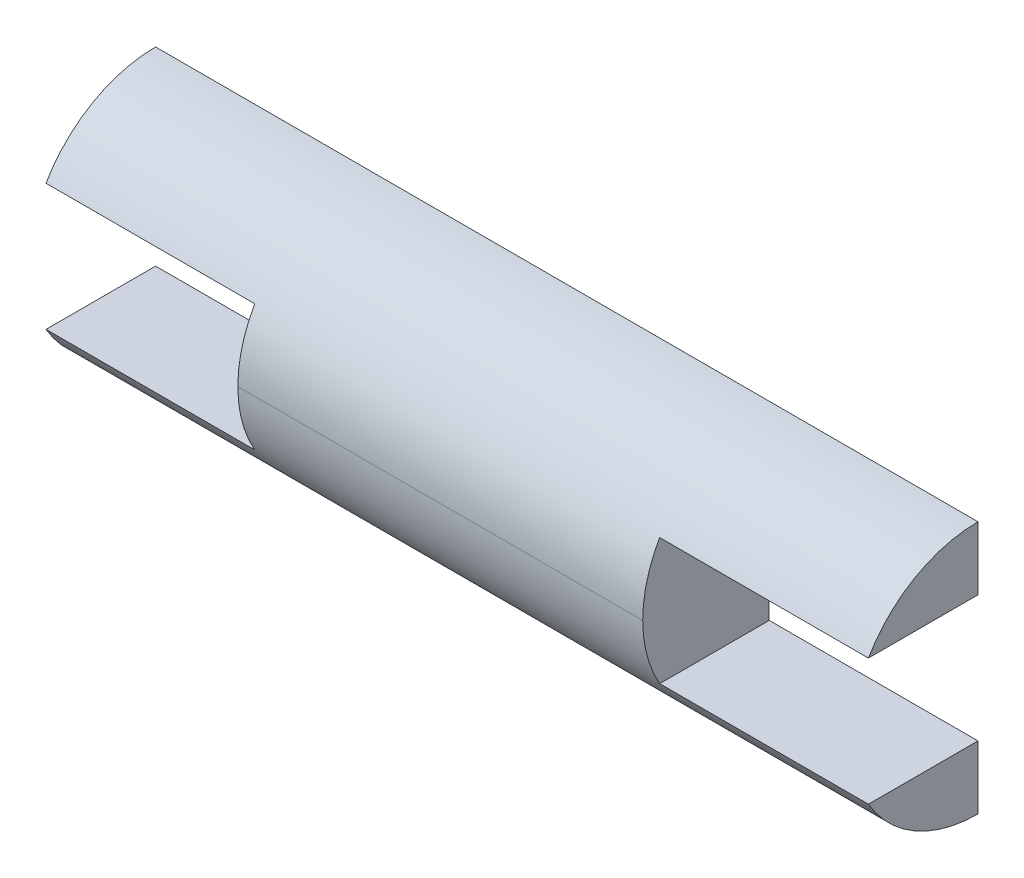
ISO-10303-21;
HEADER;
FILE_DESCRIPTION(('STEP AP214'),'2;1');
FILE_NAME('part.step','',(''),(''),'','','');
FILE_SCHEMA(('AUTOMOTIVE_DESIGN { 1 0 10303 214 1 1 1 1 }'));
ENDSEC;
DATA;
#1=APPLICATION_CONTEXT('core data for automotive mechanical design processes');
#2=APPLICATION_PROTOCOL_DEFINITION('international standard','automotive_design',2000,#1);
#3=PRODUCT_CONTEXT('',#1,'mechanical');
#4=PRODUCT('Part','Part','',(#3));
#5=PRODUCT_RELATED_PRODUCT_CATEGORY('part','',(#4));
#6=PRODUCT_DEFINITION_FORMATION('','',#4);
#7=PRODUCT_DEFINITION_CONTEXT('part definition',#1,'design');
#8=PRODUCT_DEFINITION('design','',#6,#7);
#9=PRODUCT_DEFINITION_SHAPE('','',#8);
#10=(LENGTH_UNIT() NAMED_UNIT(*) SI_UNIT(.MILLI.,.METRE.));
#11=(NAMED_UNIT(*) PLANE_ANGLE_UNIT() SI_UNIT($,.RADIAN.));
#12=(NAMED_UNIT(*) SI_UNIT($,.STERADIAN.) SOLID_ANGLE_UNIT());
#13=UNCERTAINTY_MEASURE_WITH_UNIT(LENGTH_MEASURE(1.E-05),#10,'distance_accuracy_value','');
#14=(GEOMETRIC_REPRESENTATION_CONTEXT(3) GLOBAL_UNCERTAINTY_ASSIGNED_CONTEXT((#13)) GLOBAL_UNIT_ASSIGNED_CONTEXT((#10,
#11,#12)) REPRESENTATION_CONTEXT('',''));
#15=CARTESIAN_POINT('',(0.,0.,0.));
#16=DIRECTION('',(0.,0.,1.));
#17=DIRECTION('',(1.,0.,0.));
#18=AXIS2_PLACEMENT_3D('',#15,#16,#17);
#19=CARTESIAN_POINT('',(0.,1.,2.));
#20=DIRECTION('',(1.,0.,0.));
#21=DIRECTION('',(0.,1.,0.));
#22=AXIS2_PLACEMENT_3D('',#19,#20,#21);
#23=PLANE('',#22);
#24=DIRECTION('',(0.,-1.,0.));
#25=VECTOR('',#24,1.);
#26=CARTESIAN_POINT('',(0.,1.,0.));
#27=LINE('',#26,#25);
#28=CARTESIAN_POINT('',(0.,1.,0.));
#29=VERTEX_POINT('',#28);
#30=CARTESIAN_POINT('',(0.,0.,0.));
#31=VERTEX_POINT('',#30);
#32=EDGE_CURVE('E138',#29,#31,#27,.T.);
#33=ORIENTED_EDGE('',*,*,#32,.T.);
#34=CARTESIAN_POINT('',(0.,2.,0.));
#35=DIRECTION('',(1.,0.,0.));
#36=DIRECTION('',(0.,1.,0.));
#37=AXIS2_PLACEMENT_3D('',#34,#35,#36);
#38=CIRCLE('',#37,2.);
#39=CARTESIAN_POINT('',(0.,1.,1.73205080756888));
#40=VERTEX_POINT('',#39);
#41=EDGE_CURVE('E121',#31,#40,#38,.F.);
#42=ORIENTED_EDGE('',*,*,#41,.T.);
#43=DIRECTION('',(0.,0.,-1.));
#44=VECTOR('',#43,1.);
#45=CARTESIAN_POINT('',(0.,1.,2.));
#46=LINE('',#45,#44);
#47=EDGE_CURVE('E143',#40,#29,#46,.T.);
#48=ORIENTED_EDGE('',*,*,#47,.T.);
#49=EDGE_LOOP('',(#33,#42,#48));
#50=FACE_BOUND('',#49,.T.);
#51=ADVANCED_FACE('F38',(#50),#23,.F.);
#52=CARTESIAN_POINT('',(13.,0.,2.));
#53=DIRECTION('',(-1.,0.,0.));
#54=DIRECTION('',(0.,0.,1.));
#55=AXIS2_PLACEMENT_3D('',#52,#53,#54);
#56=PLANE('',#55);
#57=DIRECTION('',(0.,0.,-1.));
#58=VECTOR('',#57,1.);
#59=CARTESIAN_POINT('',(13.,1.,2.));
#60=LINE('',#59,#58);
#61=CARTESIAN_POINT('',(13.,1.,1.73205080756888));
#62=VERTEX_POINT('',#61);
#63=CARTESIAN_POINT('',(13.,1.,0.));
#64=VERTEX_POINT('',#63);
#65=EDGE_CURVE('E187',#62,#64,#60,.T.);
#66=ORIENTED_EDGE('',*,*,#65,.F.);
#67=CARTESIAN_POINT('',(13.,2.,0.));
#68=DIRECTION('',(-1.,0.,0.));
#69=DIRECTION('',(0.,0.,1.));
#70=AXIS2_PLACEMENT_3D('',#67,#68,#69);
#71=CIRCLE('',#70,2.);
#72=CARTESIAN_POINT('',(13.,0.,0.));
#73=VERTEX_POINT('',#72);
#74=EDGE_CURVE('E131',#62,#73,#71,.F.);
#75=ORIENTED_EDGE('',*,*,#74,.T.);
#76=DIRECTION('',(0.,1.,0.));
#77=VECTOR('',#76,1.);
#78=CARTESIAN_POINT('',(13.,0.,0.));
#79=LINE('',#78,#77);
#80=EDGE_CURVE('E141',#73,#64,#79,.T.);
#81=ORIENTED_EDGE('',*,*,#80,.T.);
#82=EDGE_LOOP('',(#66,#75,#81));
#83=FACE_BOUND('',#82,.T.);
#84=ADVANCED_FACE('F235',(#83),#56,.F.);
#85=CARTESIAN_POINT('',(13.,1.,2.));
#86=DIRECTION('',(0.,-1.,0.));
#87=DIRECTION('',(1.,0.,0.));
#88=AXIS2_PLACEMENT_3D('',#85,#86,#87);
#89=PLANE('',#88);
#90=DIRECTION('',(0.,0.,-1.));
#91=VECTOR('',#90,1.);
#92=CARTESIAN_POINT('',(9.7,1.,2.));
#93=LINE('',#92,#91);
#94=CARTESIAN_POINT('',(9.7,1.,1.73205080756888));
#95=VERTEX_POINT('',#94);
#96=CARTESIAN_POINT('',(9.7,1.,0.));
#97=VERTEX_POINT('',#96);
#98=EDGE_CURVE('E185',#95,#97,#93,.T.);
#99=ORIENTED_EDGE('',*,*,#98,.F.);
#100=DIRECTION('',(-1.,0.,0.));
#101=VECTOR('',#100,1.);
#102=CARTESIAN_POINT('',(9.7,1.,1.73205080756888));
#103=LINE('',#102,#101);
#104=EDGE_CURVE('E193',#95,#62,#103,.F.);
#105=ORIENTED_EDGE('',*,*,#104,.T.);
#106=ORIENTED_EDGE('',*,*,#65,.T.);
#107=DIRECTION('',(-1.,0.,0.));
#108=VECTOR('',#107,1.);
#109=CARTESIAN_POINT('',(13.,1.,0.));
#110=LINE('',#109,#108);
#111=EDGE_CURVE('E149',#64,#97,#110,.T.);
#112=ORIENTED_EDGE('',*,*,#111,.T.);
#113=EDGE_LOOP('',(#99,#105,#106,#112));
#114=FACE_BOUND('',#113,.T.);
#115=ADVANCED_FACE('F240',(#114),#89,.F.);
#116=CARTESIAN_POINT('',(9.7,1.,2.));
#117=DIRECTION('',(-1.,0.,0.));
#118=DIRECTION('',(0.,0.,1.));
#119=AXIS2_PLACEMENT_3D('',#116,#117,#118);
#120=PLANE('',#119);
#121=CARTESIAN_POINT('',(9.7,2.,0.));
#122=DIRECTION('',(-1.,0.,0.));
#123=DIRECTION('',(0.,0.,1.));
#124=AXIS2_PLACEMENT_3D('',#121,#122,#123);
#125=CIRCLE('',#124,2.);
#126=CARTESIAN_POINT('',(9.7,3.,1.73205080756888));
#127=VERTEX_POINT('',#126);
#128=CARTESIAN_POINT('',(9.7,2.,2.));
#129=VERTEX_POINT('',#128);
#130=EDGE_CURVE('E189',#127,#129,#125,.F.);
#131=ORIENTED_EDGE('',*,*,#130,.T.);
#132=CARTESIAN_POINT('',(9.7,2.,0.));
#133=DIRECTION('',(-1.,0.,0.));
#134=DIRECTION('',(0.,0.,1.));
#135=AXIS2_PLACEMENT_3D('',#132,#133,#134);
#136=CIRCLE('',#135,2.);
#137=EDGE_CURVE('E191',#129,#95,#136,.F.);
#138=ORIENTED_EDGE('',*,*,#137,.T.);
#139=ORIENTED_EDGE('',*,*,#98,.T.);
#140=DIRECTION('',(0.,1.,0.));
#141=VECTOR('',#140,1.);
#142=CARTESIAN_POINT('',(9.7,1.,0.));
#143=LINE('',#142,#141);
#144=CARTESIAN_POINT('',(9.7,3.,0.));
#145=VERTEX_POINT('',#144);
#146=EDGE_CURVE('E152',#97,#145,#143,.T.);
#147=ORIENTED_EDGE('',*,*,#146,.T.);
#148=DIRECTION('',(0.,0.,-1.));
#149=VECTOR('',#148,1.);
#150=CARTESIAN_POINT('',(9.7,3.,2.));
#151=LINE('',#150,#149);
#152=EDGE_CURVE('E183',#127,#145,#151,.T.);
#153=ORIENTED_EDGE('',*,*,#152,.F.);
#154=EDGE_LOOP('',(#131,#138,#139,#147,#153));
#155=FACE_BOUND('',#154,.T.);
#156=ADVANCED_FACE('F220',(#155),#120,.F.);
#157=CARTESIAN_POINT('',(9.7,3.,2.));
#158=DIRECTION('',(0.,1.,0.));
#159=DIRECTION('',(-1.,0.,0.));
#160=AXIS2_PLACEMENT_3D('',#157,#158,#159);
#161=PLANE('',#160);
#162=DIRECTION('',(0.,0.,-1.));
#163=VECTOR('',#162,1.);
#164=CARTESIAN_POINT('',(13.,3.,2.));
#165=LINE('',#164,#163);
#166=CARTESIAN_POINT('',(13.,3.,1.73205080756888));
#167=VERTEX_POINT('',#166);
#168=CARTESIAN_POINT('',(13.,3.,0.));
#169=VERTEX_POINT('',#168);
#170=EDGE_CURVE('E181',#167,#169,#165,.T.);
#171=ORIENTED_EDGE('',*,*,#170,.F.);
#172=DIRECTION('',(1.,0.,0.));
#173=VECTOR('',#172,1.);
#174=CARTESIAN_POINT('',(13.,3.,1.73205080756888));
#175=LINE('',#174,#173);
#176=EDGE_CURVE('E11',#167,#127,#175,.F.);
#177=ORIENTED_EDGE('',*,*,#176,.T.);
#178=ORIENTED_EDGE('',*,*,#152,.T.);
#179=DIRECTION('',(1.,0.,0.));
#180=VECTOR('',#179,1.);
#181=CARTESIAN_POINT('',(9.7,3.,0.));
#182=LINE('',#181,#180);
#183=EDGE_CURVE('E155',#145,#169,#182,.T.);
#184=ORIENTED_EDGE('',*,*,#183,.T.);
#185=EDGE_LOOP('',(#171,#177,#178,#184));
#186=FACE_BOUND('',#185,.T.);
#187=ADVANCED_FACE('F218',(#186),#161,.F.);
#188=CARTESIAN_POINT('',(13.,3.,2.));
#189=DIRECTION('',(-1.,0.,0.));
#190=DIRECTION('',(0.,0.,1.));
#191=AXIS2_PLACEMENT_3D('',#188,#189,#190);
#192=PLANE('',#191);
#193=DIRECTION('',(0.,1.,0.));
#194=VECTOR('',#193,1.);
#195=CARTESIAN_POINT('',(13.,3.,0.));
#196=LINE('',#195,#194);
#197=CARTESIAN_POINT('',(13.,4.,0.));
#198=VERTEX_POINT('',#197);
#199=EDGE_CURVE('E158',#169,#198,#196,.T.);
#200=ORIENTED_EDGE('',*,*,#199,.T.);
#201=CARTESIAN_POINT('',(13.,2.,0.));
#202=DIRECTION('',(-1.,0.,0.));
#203=DIRECTION('',(0.,0.,1.));
#204=AXIS2_PLACEMENT_3D('',#201,#202,#203);
#205=CIRCLE('',#204,2.);
#206=EDGE_CURVE('E47',#198,#167,#205,.F.);
#207=ORIENTED_EDGE('',*,*,#206,.T.);
#208=ORIENTED_EDGE('',*,*,#170,.T.);
#209=EDGE_LOOP('',(#200,#207,#208));
#210=FACE_BOUND('',#209,.T.);
#211=ADVANCED_FACE('F224',(#210),#192,.F.);
#212=CARTESIAN_POINT('',(0.,4.,2.));
#213=DIRECTION('',(1.,0.,0.));
#214=DIRECTION('',(0.,1.,0.));
#215=AXIS2_PLACEMENT_3D('',#212,#213,#214);
#216=PLANE('',#215);
#217=DIRECTION('',(0.,0.,-1.));
#218=VECTOR('',#217,1.);
#219=CARTESIAN_POINT('',(0.,3.,2.));
#220=LINE('',#219,#218);
#221=CARTESIAN_POINT('',(0.,3.,1.73205080756888));
#222=VERTEX_POINT('',#221);
#223=CARTESIAN_POINT('',(0.,3.,0.));
#224=VERTEX_POINT('',#223);
#225=EDGE_CURVE('E179',#222,#224,#220,.T.);
#226=ORIENTED_EDGE('',*,*,#225,.F.);
#227=CARTESIAN_POINT('',(0.,2.,0.));
#228=DIRECTION('',(1.,0.,0.));
#229=DIRECTION('',(0.,1.,0.));
#230=AXIS2_PLACEMENT_3D('',#227,#228,#229);
#231=CIRCLE('',#230,2.);
#232=CARTESIAN_POINT('',(0.,4.,0.));
#233=VERTEX_POINT('',#232);
#234=EDGE_CURVE('E202',#222,#233,#231,.F.);
#235=ORIENTED_EDGE('',*,*,#234,.T.);
#236=DIRECTION('',(0.,-1.,0.));
#237=VECTOR('',#236,1.);
#238=CARTESIAN_POINT('',(0.,4.,0.));
#239=LINE('',#238,#237);
#240=EDGE_CURVE('E163',#233,#224,#239,.T.);
#241=ORIENTED_EDGE('',*,*,#240,.T.);
#242=EDGE_LOOP('',(#226,#235,#241));
#243=FACE_BOUND('',#242,.T.);
#244=ADVANCED_FACE('F207',(#243),#216,.F.);
#245=CARTESIAN_POINT('',(0.,3.,2.));
#246=DIRECTION('',(0.,1.,0.));
#247=DIRECTION('',(0.,0.,1.));
#248=AXIS2_PLACEMENT_3D('',#245,#246,#247);
#249=PLANE('',#248);
#250=DIRECTION('',(0.,0.,-1.));
#251=VECTOR('',#250,1.);
#252=CARTESIAN_POINT('',(3.3,3.,2.));
#253=LINE('',#252,#251);
#254=CARTESIAN_POINT('',(3.3,3.,1.73205080756888));
#255=VERTEX_POINT('',#254);
#256=CARTESIAN_POINT('',(3.3,3.,0.));
#257=VERTEX_POINT('',#256);
#258=EDGE_CURVE('E177',#255,#257,#253,.T.);
#259=ORIENTED_EDGE('',*,*,#258,.F.);
#260=DIRECTION('',(1.,0.,0.));
#261=VECTOR('',#260,1.);
#262=CARTESIAN_POINT('',(3.3,3.,1.73205080756888));
#263=LINE('',#262,#261);
#264=EDGE_CURVE('E61',#255,#222,#263,.F.);
#265=ORIENTED_EDGE('',*,*,#264,.T.);
#266=ORIENTED_EDGE('',*,*,#225,.T.);
#267=DIRECTION('',(1.,0.,0.));
#268=VECTOR('',#267,1.);
#269=CARTESIAN_POINT('',(0.,3.,0.));
#270=LINE('',#269,#268);
#271=EDGE_CURVE('E166',#224,#257,#270,.T.);
#272=ORIENTED_EDGE('',*,*,#271,.T.);
#273=EDGE_LOOP('',(#259,#265,#266,#272));
#274=FACE_BOUND('',#273,.T.);
#275=ADVANCED_FACE('F231',(#274),#249,.F.);
#276=CARTESIAN_POINT('',(3.3,3.,2.));
#277=DIRECTION('',(1.,0.,0.));
#278=DIRECTION('',(0.,1.,0.));
#279=AXIS2_PLACEMENT_3D('',#276,#277,#278);
#280=PLANE('',#279);
#281=DIRECTION('',(0.,0.,-1.));
#282=VECTOR('',#281,1.);
#283=CARTESIAN_POINT('',(3.3,1.,2.));
#284=LINE('',#283,#282);
#285=CARTESIAN_POINT('',(3.3,1.,1.73205080756888));
#286=VERTEX_POINT('',#285);
#287=CARTESIAN_POINT('',(3.3,1.,0.));
#288=VERTEX_POINT('',#287);
#289=EDGE_CURVE('E175',#286,#288,#284,.T.);
#290=ORIENTED_EDGE('',*,*,#289,.F.);
#291=CARTESIAN_POINT('',(3.3,2.,0.));
#292=DIRECTION('',(1.,0.,0.));
#293=DIRECTION('',(0.,1.,0.));
#294=AXIS2_PLACEMENT_3D('',#291,#292,#293);
#295=CIRCLE('',#294,2.);
#296=CARTESIAN_POINT('',(3.3,2.,2.));
#297=VERTEX_POINT('',#296);
#298=EDGE_CURVE('E199',#286,#297,#295,.F.);
#299=ORIENTED_EDGE('',*,*,#298,.T.);
#300=CARTESIAN_POINT('',(3.3,2.,0.));
#301=DIRECTION('',(1.,0.,0.));
#302=DIRECTION('',(0.,1.,0.));
#303=AXIS2_PLACEMENT_3D('',#300,#301,#302);
#304=CIRCLE('',#303,2.);
#305=EDGE_CURVE('E197',#297,#255,#304,.F.);
#306=ORIENTED_EDGE('',*,*,#305,.T.);
#307=ORIENTED_EDGE('',*,*,#258,.T.);
#308=DIRECTION('',(0.,-1.,0.));
#309=VECTOR('',#308,1.);
#310=CARTESIAN_POINT('',(3.3,3.,0.));
#311=LINE('',#310,#309);
#312=EDGE_CURVE('E169',#257,#288,#311,.T.);
#313=ORIENTED_EDGE('',*,*,#312,.T.);
#314=EDGE_LOOP('',(#290,#299,#306,#307,#313));
#315=FACE_BOUND('',#314,.T.);
#316=ADVANCED_FACE('F256',(#315),#280,.F.);
#317=CARTESIAN_POINT('',(3.3,1.,2.));
#318=DIRECTION('',(0.,-1.,0.));
#319=DIRECTION('',(1.,0.,0.));
#320=AXIS2_PLACEMENT_3D('',#317,#318,#319);
#321=PLANE('',#320);
#322=ORIENTED_EDGE('',*,*,#47,.F.);
#323=DIRECTION('',(-1.,0.,0.));
#324=VECTOR('',#323,1.);
#325=CARTESIAN_POINT('',(0.,1.,1.73205080756888));
#326=LINE('',#325,#324);
#327=EDGE_CURVE('E127',#40,#286,#326,.F.);
#328=ORIENTED_EDGE('',*,*,#327,.T.);
#329=ORIENTED_EDGE('',*,*,#289,.T.);
#330=DIRECTION('',(-1.,0.,0.));
#331=VECTOR('',#330,1.);
#332=CARTESIAN_POINT('',(3.3,1.,0.));
#333=LINE('',#332,#331);
#334=EDGE_CURVE('E172',#288,#29,#333,.T.);
#335=ORIENTED_EDGE('',*,*,#334,.T.);
#336=EDGE_LOOP('',(#322,#328,#329,#335));
#337=FACE_BOUND('',#336,.T.);
#338=ADVANCED_FACE('F251',(#337),#321,.F.);
#339=CARTESIAN_POINT('',(0.,0.,0.));
#340=DIRECTION('',(0.,0.,1.));
#341=DIRECTION('',(1.,0.,0.));
#342=AXIS2_PLACEMENT_3D('',#339,#340,#341);
#343=PLANE('',#342);
#344=ORIENTED_EDGE('',*,*,#32,.F.);
#345=ORIENTED_EDGE('',*,*,#334,.F.);
#346=ORIENTED_EDGE('',*,*,#312,.F.);
#347=ORIENTED_EDGE('',*,*,#271,.F.);
#348=ORIENTED_EDGE('',*,*,#240,.F.);
#349=DIRECTION('',(-1.,0.,0.));
#350=VECTOR('',#349,1.);
#351=CARTESIAN_POINT('',(13.,4.,0.));
#352=LINE('',#351,#350);
#353=EDGE_CURVE('E160',#198,#233,#352,.T.);
#354=ORIENTED_EDGE('',*,*,#353,.F.);
#355=ORIENTED_EDGE('',*,*,#199,.F.);
#356=ORIENTED_EDGE('',*,*,#183,.F.);
#357=ORIENTED_EDGE('',*,*,#146,.F.);
#358=ORIENTED_EDGE('',*,*,#111,.F.);
#359=ORIENTED_EDGE('',*,*,#80,.F.);
#360=DIRECTION('',(1.,0.,0.));
#361=VECTOR('',#360,1.);
#362=CARTESIAN_POINT('',(0.,0.,0.));
#363=LINE('',#362,#361);
#364=EDGE_CURVE('E125',#31,#73,#363,.T.);
#365=ORIENTED_EDGE('',*,*,#364,.F.);
#366=EDGE_LOOP('',(#344,#345,#346,#347,#348,#354,#355,#356,#357,#358,#359,#365));
#367=FACE_BOUND('',#366,.T.);
#368=ADVANCED_FACE('F136',(#367),#343,.F.);
#369=CARTESIAN_POINT('',(0.,2.,0.));
#370=DIRECTION('',(1.,0.,0.));
#371=DIRECTION('',(0.,1.,0.));
#372=AXIS2_PLACEMENT_3D('',#369,#370,#371);
#373=CYLINDRICAL_SURFACE('',#372,2.);
#374=ORIENTED_EDGE('',*,*,#264,.F.);
#375=ORIENTED_EDGE('',*,*,#305,.F.);
#376=DIRECTION('',(-1.,0.,0.));
#377=VECTOR('',#376,1.);
#378=CARTESIAN_POINT('',(0.,2.,2.));
#379=LINE('',#378,#377);
#380=EDGE_CURVE('E42',#129,#297,#379,.T.);
#381=ORIENTED_EDGE('',*,*,#380,.F.);
#382=ORIENTED_EDGE('',*,*,#130,.F.);
#383=ORIENTED_EDGE('',*,*,#176,.F.);
#384=ORIENTED_EDGE('',*,*,#206,.F.);
#385=ORIENTED_EDGE('',*,*,#353,.T.);
#386=ORIENTED_EDGE('',*,*,#234,.F.);
#387=EDGE_LOOP('',(#374,#375,#381,#382,#383,#384,#385,#386));
#388=FACE_BOUND('',#387,.T.);
#389=ADVANCED_FACE('F40',(#388),#373,.T.);
#390=CARTESIAN_POINT('',(0.,2.,0.));
#391=DIRECTION('',(-1.,0.,0.));
#392=DIRECTION('',(0.,0.,1.));
#393=AXIS2_PLACEMENT_3D('',#390,#391,#392);
#394=CYLINDRICAL_SURFACE('',#393,2.);
#395=ORIENTED_EDGE('',*,*,#41,.F.);
#396=ORIENTED_EDGE('',*,*,#364,.T.);
#397=ORIENTED_EDGE('',*,*,#74,.F.);
#398=ORIENTED_EDGE('',*,*,#104,.F.);
#399=ORIENTED_EDGE('',*,*,#137,.F.);
#400=ORIENTED_EDGE('',*,*,#380,.T.);
#401=ORIENTED_EDGE('',*,*,#298,.F.);
#402=ORIENTED_EDGE('',*,*,#327,.F.);
#403=EDGE_LOOP('',(#395,#396,#397,#398,#399,#400,#401,#402));
#404=FACE_BOUND('',#403,.T.);
#405=ADVANCED_FACE('F123',(#404),#394,.T.);
#406=CLOSED_SHELL('',(#51,#84,#115,#156,#187,#211,#244,#275,#316,#338,#368,#389,#405));
#407=MANIFOLD_SOLID_BREP('B2',#406);
#408=ADVANCED_BREP_SHAPE_REPRESENTATION('',(#18,#407),#14);
#409=SHAPE_DEFINITION_REPRESENTATION(#9,#408);
ENDSEC;
END-ISO-10303-21;
